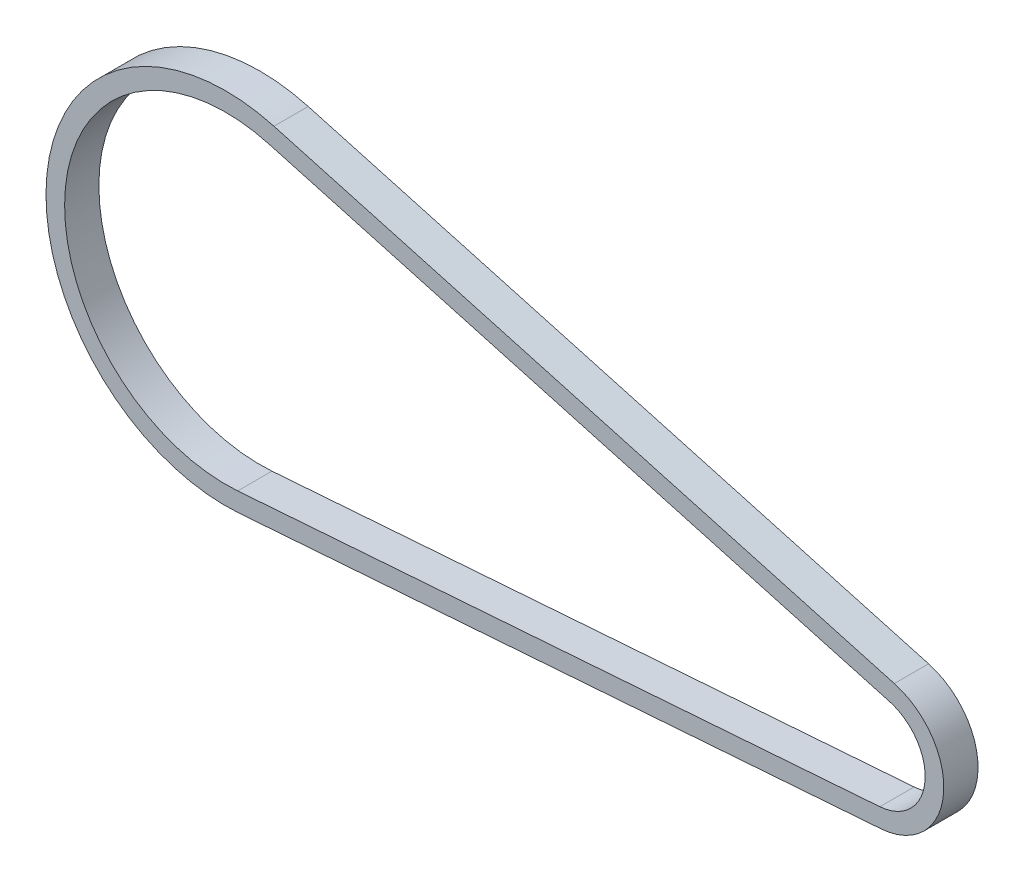
ISO-10303-21;
HEADER;
FILE_DESCRIPTION(('STEP AP214'),'2;1');
FILE_NAME('part.step','',(''),(''),'','','');
FILE_SCHEMA(('AUTOMOTIVE_DESIGN { 1 0 10303 214 1 1 1 1 }'));
ENDSEC;
DATA;
#1=APPLICATION_CONTEXT('core data for automotive mechanical design processes');
#2=APPLICATION_PROTOCOL_DEFINITION('international standard','automotive_design',2000,#1);
#3=PRODUCT_CONTEXT('',#1,'mechanical');
#4=PRODUCT('Part','Part','',(#3));
#5=PRODUCT_RELATED_PRODUCT_CATEGORY('part','',(#4));
#6=PRODUCT_DEFINITION_FORMATION('','',#4);
#7=PRODUCT_DEFINITION_CONTEXT('part definition',#1,'design');
#8=PRODUCT_DEFINITION('design','',#6,#7);
#9=PRODUCT_DEFINITION_SHAPE('','',#8);
#10=(LENGTH_UNIT() NAMED_UNIT(*) SI_UNIT(.MILLI.,.METRE.));
#11=(NAMED_UNIT(*) PLANE_ANGLE_UNIT() SI_UNIT($,.RADIAN.));
#12=(NAMED_UNIT(*) SI_UNIT($,.STERADIAN.) SOLID_ANGLE_UNIT());
#13=UNCERTAINTY_MEASURE_WITH_UNIT(LENGTH_MEASURE(1.E-05),#10,'distance_accuracy_value','');
#14=(GEOMETRIC_REPRESENTATION_CONTEXT(3) GLOBAL_UNCERTAINTY_ASSIGNED_CONTEXT((#13)) GLOBAL_UNIT_ASSIGNED_CONTEXT((#10,
#11,#12)) REPRESENTATION_CONTEXT('',''));
#15=CARTESIAN_POINT('',(0.,0.,0.));
#16=DIRECTION('',(0.,0.,1.));
#17=DIRECTION('',(1.,0.,0.));
#18=AXIS2_PLACEMENT_3D('',#15,#16,#17);
#19=CARTESIAN_POINT('',(486.019726037193,-97.662831573185,12.7));
#20=DIRECTION('',(0.0739065883456241,-0.997265168447745,0.));
#21=DIRECTION('',(0.997265168447746,0.0739065883456241,0.));
#22=AXIS2_PLACEMENT_3D('',#19,#20,#21);
#23=PLANE('',#22);
#24=DIRECTION('',(0.,0.,1.));
#25=VECTOR('',#24,1.);
#26=CARTESIAN_POINT('',(486.019726037193,-97.662831573185,12.7));
#27=LINE('',#26,#25);
#28=CARTESIAN_POINT('',(486.019726037193,-97.662831573185,-12.7));
#29=VERTEX_POINT('',#28);
#30=CARTESIAN_POINT('',(486.019726037193,-97.662831573185,12.7));
#31=VERTEX_POINT('',#30);
#32=EDGE_CURVE('E137',#29,#31,#27,.T.);
#33=ORIENTED_EDGE('',*,*,#32,.T.);
#34=DIRECTION('',(-0.997265168447746,-0.0739065883456241,0.));
#35=VECTOR('',#34,1.);
#36=CARTESIAN_POINT('',(486.019726037193,-97.662831573185,12.7));
#37=LINE('',#36,#35);
#38=CARTESIAN_POINT('',(9.85291595056759,-132.951203743746,12.7));
#39=VERTEX_POINT('',#38);
#40=EDGE_CURVE('E43',#31,#39,#37,.T.);
#41=ORIENTED_EDGE('',*,*,#40,.T.);
#42=DIRECTION('',(0.,0.,1.));
#43=VECTOR('',#42,1.);
#44=CARTESIAN_POINT('',(9.85291595056759,-132.951203743746,12.7));
#45=LINE('',#44,#43);
#46=CARTESIAN_POINT('',(9.85291595056759,-132.951203743746,-12.7));
#47=VERTEX_POINT('',#46);
#48=EDGE_CURVE('E154',#47,#39,#45,.T.);
#49=ORIENTED_EDGE('',*,*,#48,.F.);
#50=DIRECTION('',(-0.997265168447746,-0.0739065883456241,0.));
#51=VECTOR('',#50,1.);
#52=CARTESIAN_POINT('',(486.019726037193,-97.662831573185,-12.7));
#53=LINE('',#52,#51);
#54=EDGE_CURVE('E11',#29,#47,#53,.T.);
#55=ORIENTED_EDGE('',*,*,#54,.F.);
#56=EDGE_LOOP('',(#33,#41,#49,#55));
#57=FACE_BOUND('',#56,.T.);
#58=ADVANCED_FACE('F35',(#57),#23,.T.);
#59=CARTESIAN_POINT('',(484.999815118023,-83.9005722486061,12.7));
#60=DIRECTION('',(-0.0739065883456241,0.997265168447745,0.));
#61=DIRECTION('',(-0.997265168447746,-0.0739065883456241,0.));
#62=AXIS2_PLACEMENT_3D('',#59,#60,#61);
#63=PLANE('',#62);
#64=DIRECTION('',(0.,0.,-1.));
#65=VECTOR('',#64,1.);
#66=CARTESIAN_POINT('',(484.999815118023,-83.9005722486061,12.7));
#67=LINE('',#66,#65);
#68=CARTESIAN_POINT('',(484.999815118023,-83.9005722486061,12.7));
#69=VERTEX_POINT('',#68);
#70=CARTESIAN_POINT('',(484.999815118023,-83.9005722486061,-12.7));
#71=VERTEX_POINT('',#70);
#72=EDGE_CURVE('E111',#69,#71,#67,.T.);
#73=ORIENTED_EDGE('',*,*,#72,.T.);
#74=DIRECTION('',(-0.997265168447746,-0.0739065883456241,0.));
#75=VECTOR('',#74,1.);
#76=CARTESIAN_POINT('',(484.999815118023,-83.9005722486061,-12.7));
#77=LINE('',#76,#75);
#78=CARTESIAN_POINT('',(8.833005031398,-119.188944419167,-12.7));
#79=VERTEX_POINT('',#78);
#80=EDGE_CURVE('E156',#71,#79,#77,.T.);
#81=ORIENTED_EDGE('',*,*,#80,.T.);
#82=DIRECTION('',(0.,0.,-1.));
#83=VECTOR('',#82,1.);
#84=CARTESIAN_POINT('',(8.833005031398,-119.188944419167,12.7));
#85=LINE('',#84,#83);
#86=CARTESIAN_POINT('',(8.833005031398,-119.188944419167,12.7));
#87=VERTEX_POINT('',#86);
#88=EDGE_CURVE('E151',#87,#79,#85,.T.);
#89=ORIENTED_EDGE('',*,*,#88,.F.);
#90=DIRECTION('',(-0.997265168447746,-0.0739065883456241,0.));
#91=VECTOR('',#90,1.);
#92=CARTESIAN_POINT('',(484.999815118023,-83.9005722486061,12.7));
#93=LINE('',#92,#91);
#94=EDGE_CURVE('E159',#69,#87,#93,.T.);
#95=ORIENTED_EDGE('',*,*,#94,.F.);
#96=EDGE_LOOP('',(#73,#81,#89,#95));
#97=FACE_BOUND('',#96,.T.);
#98=ADVANCED_FACE('F180',(#97),#63,.T.);
#99=CARTESIAN_POINT('',(482.317545479172,-47.7071266696826,0.));
#100=DIRECTION('',(0.,0.,-1.));
#101=DIRECTION('',(-1.,0.,0.));
#102=AXIS2_PLACEMENT_3D('',#99,#100,#101);
#103=CYLINDRICAL_SURFACE('',#102,50.0927);
#104=DIRECTION('',(0.,0.,1.));
#105=VECTOR('',#104,1.);
#106=CARTESIAN_POINT('',(495.734701678442,0.55526565409672,12.7));
#107=LINE('',#106,#105);
#108=CARTESIAN_POINT('',(495.734701678442,0.55526565409672,-12.7));
#109=VERTEX_POINT('',#108);
#110=CARTESIAN_POINT('',(495.734701678442,0.55526565409672,12.7));
#111=VERTEX_POINT('',#110);
#112=EDGE_CURVE('E108',#109,#111,#107,.T.);
#113=ORIENTED_EDGE('',*,*,#112,.T.);
#114=CARTESIAN_POINT('',(482.317545479172,-47.7071266696826,12.7));
#115=DIRECTION('',(0.,0.,-1.));
#116=DIRECTION('',(-1.,0.,0.));
#117=AXIS2_PLACEMENT_3D('',#114,#115,#116);
#118=CIRCLE('',#117,50.0927);
#119=EDGE_CURVE('E146',#111,#31,#118,.T.);
#120=ORIENTED_EDGE('',*,*,#119,.T.);
#121=ORIENTED_EDGE('',*,*,#32,.F.);
#122=CARTESIAN_POINT('',(482.317545479172,-47.7071266696826,-12.7));
#123=DIRECTION('',(0.,0.,-1.));
#124=DIRECTION('',(-1.,0.,0.));
#125=AXIS2_PLACEMENT_3D('',#122,#123,#124);
#126=CIRCLE('',#125,50.0927);
#127=EDGE_CURVE('E149',#109,#29,#126,.T.);
#128=ORIENTED_EDGE('',*,*,#127,.F.);
#129=EDGE_LOOP('',(#113,#120,#121,#128));
#130=FACE_BOUND('',#129,.T.);
#131=ADVANCED_FACE('F202',(#130),#103,.T.);
#132=CARTESIAN_POINT('',(482.317545479172,-47.7071266696826,0.));
#133=DIRECTION('',(0.,0.,-1.));
#134=DIRECTION('',(-1.,0.,0.));
#135=AXIS2_PLACEMENT_3D('',#132,#133,#134);
#136=CYLINDRICAL_SURFACE('',#135,36.2927);
#137=DIRECTION('',(0.,0.,-1.));
#138=VECTOR('',#137,1.);
#139=CARTESIAN_POINT('',(492.038419474649,-12.7405042698274,12.7));
#140=LINE('',#139,#138);
#141=CARTESIAN_POINT('',(492.038419474649,-12.7405042698274,12.7));
#142=VERTEX_POINT('',#141);
#143=CARTESIAN_POINT('',(492.038419474649,-12.7405042698274,-12.7));
#144=VERTEX_POINT('',#143);
#145=EDGE_CURVE('E116',#142,#144,#140,.T.);
#146=ORIENTED_EDGE('',*,*,#145,.T.);
#147=CARTESIAN_POINT('',(482.317545479172,-47.7071266696826,-12.7));
#148=DIRECTION('',(0.,0.,-1.));
#149=DIRECTION('',(-1.,0.,0.));
#150=AXIS2_PLACEMENT_3D('',#147,#148,#149);
#151=CIRCLE('',#150,36.2927);
#152=EDGE_CURVE('E140',#144,#71,#151,.T.);
#153=ORIENTED_EDGE('',*,*,#152,.T.);
#154=ORIENTED_EDGE('',*,*,#72,.F.);
#155=CARTESIAN_POINT('',(482.317545479172,-47.7071266696826,12.7));
#156=DIRECTION('',(0.,0.,-1.));
#157=DIRECTION('',(-1.,0.,0.));
#158=AXIS2_PLACEMENT_3D('',#155,#156,#157);
#159=CIRCLE('',#158,36.2927);
#160=EDGE_CURVE('E143',#142,#69,#159,.T.);
#161=ORIENTED_EDGE('',*,*,#160,.F.);
#162=EDGE_LOOP('',(#146,#153,#154,#161));
#163=FACE_BOUND('',#162,.T.);
#164=ADVANCED_FACE('F185',(#163),#136,.F.);
#165=CARTESIAN_POINT('',(35.7081752916215,128.444652465499,12.7));
#166=DIRECTION('',(0.267846536506712,0.963461588690155,0.));
#167=DIRECTION('',(-0.963461588690156,0.267846536506712,0.));
#168=AXIS2_PLACEMENT_3D('',#165,#166,#167);
#169=PLANE('',#168);
#170=DIRECTION('',(0.,0.,1.));
#171=VECTOR('',#170,1.);
#172=CARTESIAN_POINT('',(35.7081752916215,128.444652465499,12.7));
#173=LINE('',#172,#171);
#174=CARTESIAN_POINT('',(35.7081752916215,128.444652465499,-12.7));
#175=VERTEX_POINT('',#174);
#176=CARTESIAN_POINT('',(35.7081752916215,128.444652465499,12.7));
#177=VERTEX_POINT('',#176);
#178=EDGE_CURVE('E106',#175,#177,#173,.T.);
#179=ORIENTED_EDGE('',*,*,#178,.T.);
#180=DIRECTION('',(0.963461588690155,-0.267846536506712,0.));
#181=VECTOR('',#180,1.);
#182=CARTESIAN_POINT('',(35.7081752916215,128.444652465499,12.7));
#183=LINE('',#182,#181);
#184=EDGE_CURVE('E112',#177,#111,#183,.T.);
#185=ORIENTED_EDGE('',*,*,#184,.T.);
#186=ORIENTED_EDGE('',*,*,#112,.F.);
#187=DIRECTION('',(0.963461588690155,-0.267846536506712,0.));
#188=VECTOR('',#187,1.);
#189=CARTESIAN_POINT('',(35.7081752916215,128.444652465499,-12.7));
#190=LINE('',#189,#188);
#191=EDGE_CURVE('E103',#175,#109,#190,.T.);
#192=ORIENTED_EDGE('',*,*,#191,.F.);
#193=EDGE_LOOP('',(#179,#185,#186,#192));
#194=FACE_BOUND('',#193,.T.);
#195=ADVANCED_FACE('F104',(#194),#169,.T.);
#196=CARTESIAN_POINT('',(32.0118930878289,115.148882541575,12.7));
#197=DIRECTION('',(-0.267846536506712,-0.963461588690155,0.));
#198=DIRECTION('',(0.963461588690156,-0.267846536506712,0.));
#199=AXIS2_PLACEMENT_3D('',#196,#197,#198);
#200=PLANE('',#199);
#201=DIRECTION('',(0.,0.,-1.));
#202=VECTOR('',#201,1.);
#203=CARTESIAN_POINT('',(32.0118930878289,115.148882541575,12.7));
#204=LINE('',#203,#202);
#205=CARTESIAN_POINT('',(32.0118930878289,115.148882541575,12.7));
#206=VERTEX_POINT('',#205);
#207=CARTESIAN_POINT('',(32.0118930878289,115.148882541575,-12.7));
#208=VERTEX_POINT('',#207);
#209=EDGE_CURVE('E119',#206,#208,#204,.T.);
#210=ORIENTED_EDGE('',*,*,#209,.T.);
#211=DIRECTION('',(0.963461588690155,-0.267846536506712,0.));
#212=VECTOR('',#211,1.);
#213=CARTESIAN_POINT('',(32.0118930878289,115.148882541575,-12.7));
#214=LINE('',#213,#212);
#215=EDGE_CURVE('E128',#208,#144,#214,.T.);
#216=ORIENTED_EDGE('',*,*,#215,.T.);
#217=ORIENTED_EDGE('',*,*,#145,.F.);
#218=DIRECTION('',(0.963461588690155,-0.267846536506712,0.));
#219=VECTOR('',#218,1.);
#220=CARTESIAN_POINT('',(32.0118930878289,115.148882541575,12.7));
#221=LINE('',#220,#219);
#222=EDGE_CURVE('E131',#206,#142,#221,.T.);
#223=ORIENTED_EDGE('',*,*,#222,.F.);
#224=EDGE_LOOP('',(#210,#216,#217,#223));
#225=FACE_BOUND('',#224,.T.);
#226=ADVANCED_FACE('F187',(#225),#200,.T.);
#227=CARTESIAN_POINT('',(35.7081752916215,128.444652465499,-12.7));
#228=DIRECTION('',(0.,0.,1.));
#229=DIRECTION('',(1.,0.,0.));
#230=AXIS2_PLACEMENT_3D('',#227,#228,#229);
#231=PLANE('',#230);
#232=CARTESIAN_POINT('',(0.,0.,-12.7));
#233=DIRECTION('',(0.,0.,1.));
#234=DIRECTION('',(1.,0.,0.));
#235=AXIS2_PLACEMENT_3D('',#232,#233,#234);
#236=CIRCLE('',#235,133.3158);
#237=EDGE_CURVE('E51',#175,#47,#236,.T.);
#238=ORIENTED_EDGE('',*,*,#237,.F.);
#239=ORIENTED_EDGE('',*,*,#191,.T.);
#240=ORIENTED_EDGE('',*,*,#127,.T.);
#241=ORIENTED_EDGE('',*,*,#54,.T.);
#242=EDGE_LOOP('',(#238,#239,#240,#241));
#243=FACE_BOUND('',#242,.T.);
#244=ORIENTED_EDGE('',*,*,#215,.F.);
#245=CARTESIAN_POINT('',(0.,0.,-12.7));
#246=DIRECTION('',(0.,0.,1.));
#247=DIRECTION('',(1.,0.,0.));
#248=AXIS2_PLACEMENT_3D('',#245,#246,#247);
#249=CIRCLE('',#248,119.5158);
#250=EDGE_CURVE('E122',#208,#79,#249,.T.);
#251=ORIENTED_EDGE('',*,*,#250,.T.);
#252=ORIENTED_EDGE('',*,*,#80,.F.);
#253=ORIENTED_EDGE('',*,*,#152,.F.);
#254=EDGE_LOOP('',(#244,#251,#252,#253));
#255=FACE_BOUND('',#254,.T.);
#256=ADVANCED_FACE('F114',(#243,#255),#231,.F.);
#257=CARTESIAN_POINT('',(0.,0.,0.));
#258=DIRECTION('',(0.,0.,1.));
#259=DIRECTION('',(1.,0.,0.));
#260=AXIS2_PLACEMENT_3D('',#257,#258,#259);
#261=CYLINDRICAL_SURFACE('',#260,133.3158);
#262=CARTESIAN_POINT('',(0.,0.,12.7));
#263=DIRECTION('',(0.,0.,1.));
#264=DIRECTION('',(1.,0.,0.));
#265=AXIS2_PLACEMENT_3D('',#262,#263,#264);
#266=CIRCLE('',#265,133.3158);
#267=EDGE_CURVE('E59',#177,#39,#266,.T.);
#268=ORIENTED_EDGE('',*,*,#267,.F.);
#269=ORIENTED_EDGE('',*,*,#178,.F.);
#270=ORIENTED_EDGE('',*,*,#237,.T.);
#271=ORIENTED_EDGE('',*,*,#48,.T.);
#272=EDGE_LOOP('',(#268,#269,#270,#271));
#273=FACE_BOUND('',#272,.T.);
#274=ADVANCED_FACE('F118',(#273),#261,.T.);
#275=CARTESIAN_POINT('',(35.7081752916215,128.444652465499,12.7));
#276=DIRECTION('',(0.,0.,-1.));
#277=DIRECTION('',(-1.,0.,0.));
#278=AXIS2_PLACEMENT_3D('',#275,#276,#277);
#279=PLANE('',#278);
#280=CARTESIAN_POINT('',(0.,0.,12.7));
#281=DIRECTION('',(0.,0.,1.));
#282=DIRECTION('',(1.,0.,0.));
#283=AXIS2_PLACEMENT_3D('',#280,#281,#282);
#284=CIRCLE('',#283,119.5158);
#285=EDGE_CURVE('E167',#206,#87,#284,.T.);
#286=ORIENTED_EDGE('',*,*,#285,.F.);
#287=ORIENTED_EDGE('',*,*,#222,.T.);
#288=ORIENTED_EDGE('',*,*,#160,.T.);
#289=ORIENTED_EDGE('',*,*,#94,.T.);
#290=EDGE_LOOP('',(#286,#287,#288,#289));
#291=FACE_BOUND('',#290,.T.);
#292=ORIENTED_EDGE('',*,*,#184,.F.);
#293=ORIENTED_EDGE('',*,*,#267,.T.);
#294=ORIENTED_EDGE('',*,*,#40,.F.);
#295=ORIENTED_EDGE('',*,*,#119,.F.);
#296=EDGE_LOOP('',(#292,#293,#294,#295));
#297=FACE_BOUND('',#296,.T.);
#298=ADVANCED_FACE('F182',(#291,#297),#279,.F.);
#299=CARTESIAN_POINT('',(0.,0.,0.));
#300=DIRECTION('',(0.,0.,1.));
#301=DIRECTION('',(1.,0.,0.));
#302=AXIS2_PLACEMENT_3D('',#299,#300,#301);
#303=CYLINDRICAL_SURFACE('',#302,119.5158);
#304=ORIENTED_EDGE('',*,*,#209,.F.);
#305=ORIENTED_EDGE('',*,*,#285,.T.);
#306=ORIENTED_EDGE('',*,*,#88,.T.);
#307=ORIENTED_EDGE('',*,*,#250,.F.);
#308=EDGE_LOOP('',(#304,#305,#306,#307));
#309=FACE_BOUND('',#308,.T.);
#310=ADVANCED_FACE('F176',(#309),#303,.F.);
#311=CLOSED_SHELL('',(#58,#98,#131,#164,#195,#226,#256,#274,#298,#310));
#312=MANIFOLD_SOLID_BREP('B2',#311);
#313=ADVANCED_BREP_SHAPE_REPRESENTATION('',(#18,#312),#14);
#314=SHAPE_DEFINITION_REPRESENTATION(#9,#313);
ENDSEC;
END-ISO-10303-21;
